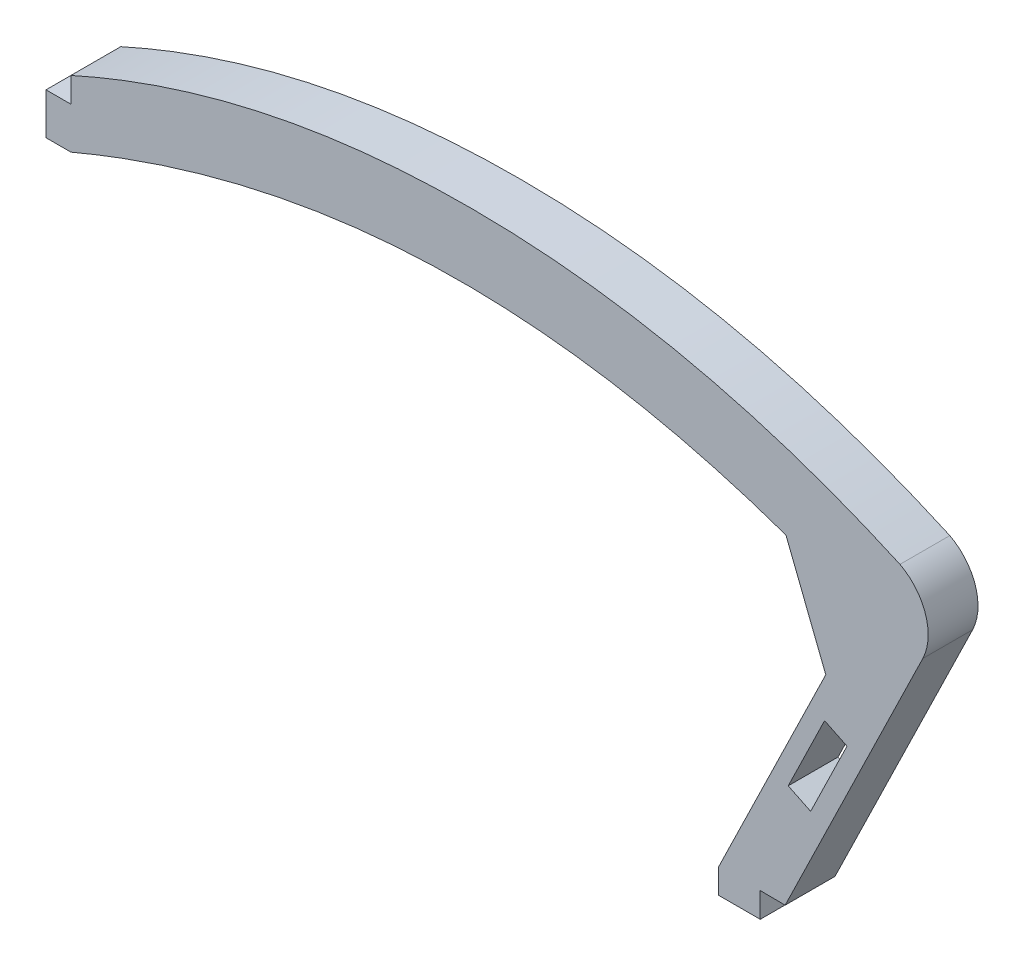
ISO-10303-21;
HEADER;
FILE_DESCRIPTION(('STEP AP214'),'2;1');
FILE_NAME('part.step','',(''),(''),'','','');
FILE_SCHEMA(('AUTOMOTIVE_DESIGN { 1 0 10303 214 1 1 1 1 }'));
ENDSEC;
DATA;
#1=APPLICATION_CONTEXT('core data for automotive mechanical design processes');
#2=APPLICATION_PROTOCOL_DEFINITION('international standard','automotive_design',2000,#1);
#3=PRODUCT_CONTEXT('',#1,'mechanical');
#4=PRODUCT('Part','Part','',(#3));
#5=PRODUCT_RELATED_PRODUCT_CATEGORY('part','',(#4));
#6=PRODUCT_DEFINITION_FORMATION('','',#4);
#7=PRODUCT_DEFINITION_CONTEXT('part definition',#1,'design');
#8=PRODUCT_DEFINITION('design','',#6,#7);
#9=PRODUCT_DEFINITION_SHAPE('','',#8);
#10=(LENGTH_UNIT() NAMED_UNIT(*) SI_UNIT(.MILLI.,.METRE.));
#11=(NAMED_UNIT(*) PLANE_ANGLE_UNIT() SI_UNIT($,.RADIAN.));
#12=(NAMED_UNIT(*) SI_UNIT($,.STERADIAN.) SOLID_ANGLE_UNIT());
#13=UNCERTAINTY_MEASURE_WITH_UNIT(LENGTH_MEASURE(1.E-05),#10,'distance_accuracy_value','');
#14=(GEOMETRIC_REPRESENTATION_CONTEXT(3) GLOBAL_UNCERTAINTY_ASSIGNED_CONTEXT((#13)) GLOBAL_UNIT_ASSIGNED_CONTEXT((#10,
#11,#12)) REPRESENTATION_CONTEXT('',''));
#15=CARTESIAN_POINT('',(0.,0.,0.));
#16=DIRECTION('',(0.,0.,1.));
#17=DIRECTION('',(1.,0.,0.));
#18=AXIS2_PLACEMENT_3D('',#15,#16,#17);
#19=CARTESIAN_POINT('',(18.8316095196413,36.7877841974259,6.));
#20=DIRECTION('',(0.,0.,-1.));
#21=DIRECTION('',(-1.,0.,0.));
#22=AXIS2_PLACEMENT_3D('',#19,#20,#21);
#23=CYLINDRICAL_SURFACE('',#22,6.38889912729138);
#24=CARTESIAN_POINT('',(18.8316095196413,36.7877841974259,0.));
#25=DIRECTION('',(0.,0.,1.));
#26=DIRECTION('',(1.,0.,0.));
#27=AXIS2_PLACEMENT_3D('',#24,#25,#26);
#28=CIRCLE('',#27,6.38889912729138);
#29=CARTESIAN_POINT('',(24.5748107662097,33.9889145148364,0.));
#30=VERTEX_POINT('',#29);
#31=CARTESIAN_POINT('',(21.8264630921922,42.4312657591645,0.));
#32=VERTEX_POINT('',#31);
#33=EDGE_CURVE('E211',#30,#32,#28,.T.);
#34=ORIENTED_EDGE('',*,*,#33,.T.);
#35=DIRECTION('',(0.,0.,-1.));
#36=VECTOR('',#35,1.);
#37=CARTESIAN_POINT('',(21.8264630921922,42.4312657591645,6.));
#38=LINE('',#37,#36);
#39=CARTESIAN_POINT('',(21.8264630921922,42.4312657591645,6.));
#40=VERTEX_POINT('',#39);
#41=EDGE_CURVE('E250',#40,#32,#38,.T.);
#42=ORIENTED_EDGE('',*,*,#41,.F.);
#43=CARTESIAN_POINT('',(18.8316095196413,36.7877841974259,6.));
#44=DIRECTION('',(0.,0.,1.));
#45=DIRECTION('',(1.,0.,0.));
#46=AXIS2_PLACEMENT_3D('',#43,#44,#45);
#47=CIRCLE('',#46,6.38889912729138);
#48=CARTESIAN_POINT('',(24.5748107662097,33.9889145148364,6.));
#49=VERTEX_POINT('',#48);
#50=EDGE_CURVE('E217',#49,#40,#47,.T.);
#51=ORIENTED_EDGE('',*,*,#50,.F.);
#52=DIRECTION('',(0.,0.,-1.));
#53=VECTOR('',#52,1.);
#54=CARTESIAN_POINT('',(24.5748107662097,33.9889145148364,6.));
#55=LINE('',#54,#53);
#56=EDGE_CURVE('E252',#49,#30,#55,.T.);
#57=ORIENTED_EDGE('',*,*,#56,.T.);
#58=EDGE_LOOP('',(#34,#42,#51,#57));
#59=FACE_BOUND('',#58,.T.);
#60=ADVANCED_FACE('F43',(#59),#23,.T.);
#61=CARTESIAN_POINT('',(21.8264630921922,42.4312657591645,6.));
#62=CARTESIAN_POINT('',(4.30347785726403,50.3433786545245,6.));
#63=CARTESIAN_POINT('',(-29.026405501552,57.0183047926159,6.));
#64=CARTESIAN_POINT('',(-62.2418203349168,50.6205074438955,6.));
#65=CARTESIAN_POINT('',(-77.9999999984884,43.5,6.));
#66=B_SPLINE_CURVE_WITH_KNOTS('',3,(#61,#62,#63,#64,#65),.UNSPECIFIED.,.F.,.F.,(4,1,4),
(0.0183848982386074,0.528855814446571,0.99108454483135),.UNSPECIFIED.);
#67=DIRECTION('',(0.,0.,-1.));
#68=VECTOR('',#67,1.);
#69=SURFACE_OF_LINEAR_EXTRUSION('',#66,#68);
#70=CARTESIAN_POINT('',(21.8264630921922,42.4312657591645,0.));
#71=CARTESIAN_POINT('',(4.30347785726403,50.3433786545245,0.));
#72=CARTESIAN_POINT('',(-29.026405501552,57.0183047926159,0.));
#73=CARTESIAN_POINT('',(-62.2418203349168,50.6205074438955,0.));
#74=CARTESIAN_POINT('',(-77.9999999984884,43.5,0.));
#75=B_SPLINE_CURVE_WITH_KNOTS('',3,(#70,#71,#72,#73,#74),.UNSPECIFIED.,.F.,.F.,(4,1,4),
(0.0183848982386074,0.528855814446571,0.99108454483135),.UNSPECIFIED.);
#76=CARTESIAN_POINT('',(-77.9999999984884,43.5,0.));
#77=VERTEX_POINT('',#76);
#78=EDGE_CURVE('E255',#32,#77,#75,.T.);
#79=ORIENTED_EDGE('',*,*,#78,.T.);
#80=DIRECTION('',(0.,0.,-1.));
#81=VECTOR('',#80,1.);
#82=CARTESIAN_POINT('',(-77.9999999984884,43.5,6.));
#83=LINE('',#82,#81);
#84=CARTESIAN_POINT('',(-77.9999999984884,43.5,6.));
#85=VERTEX_POINT('',#84);
#86=EDGE_CURVE('E345',#85,#77,#83,.T.);
#87=ORIENTED_EDGE('',*,*,#86,.F.);
#88=EDGE_CURVE('E221',#40,#85,#66,.T.);
#89=ORIENTED_EDGE('',*,*,#88,.F.);
#90=ORIENTED_EDGE('',*,*,#41,.T.);
#91=EDGE_LOOP('',(#79,#87,#89,#90));
#92=FACE_BOUND('',#91,.T.);
#93=ADVANCED_FACE('F234',(#92),#69,.F.);
#94=CARTESIAN_POINT('',(-77.9999999984884,0.,6.));
#95=DIRECTION('',(-1.,0.,0.));
#96=DIRECTION('',(0.,0.,1.));
#97=AXIS2_PLACEMENT_3D('',#94,#95,#96);
#98=PLANE('',#97);
#99=DIRECTION('',(0.,1.,0.));
#100=VECTOR('',#99,1.);
#101=CARTESIAN_POINT('',(-77.9999999984884,0.,0.));
#102=LINE('',#101,#100);
#103=CARTESIAN_POINT('',(-77.9999999984884,40.5,0.));
#104=VERTEX_POINT('',#103);
#105=EDGE_CURVE('E259',#104,#77,#102,.T.);
#106=ORIENTED_EDGE('',*,*,#105,.F.);
#107=DIRECTION('',(0.,0.,-1.));
#108=VECTOR('',#107,1.);
#109=CARTESIAN_POINT('',(-77.9999999984884,40.5,6.));
#110=LINE('',#109,#108);
#111=CARTESIAN_POINT('',(-77.9999999984884,40.5,6.));
#112=VERTEX_POINT('',#111);
#113=EDGE_CURVE('E342',#112,#104,#110,.T.);
#114=ORIENTED_EDGE('',*,*,#113,.F.);
#115=DIRECTION('',(0.,1.,0.));
#116=VECTOR('',#115,1.);
#117=CARTESIAN_POINT('',(-77.9999999984884,0.,6.));
#118=LINE('',#117,#116);
#119=EDGE_CURVE('E228',#112,#85,#118,.T.);
#120=ORIENTED_EDGE('',*,*,#119,.T.);
#121=ORIENTED_EDGE('',*,*,#86,.T.);
#122=EDGE_LOOP('',(#106,#114,#120,#121));
#123=FACE_BOUND('',#122,.T.);
#124=ADVANCED_FACE('F237',(#123),#98,.T.);
#125=CARTESIAN_POINT('',(0.,40.5,6.));
#126=DIRECTION('',(0.,1.,0.));
#127=DIRECTION('',(0.,0.,1.));
#128=AXIS2_PLACEMENT_3D('',#125,#126,#127);
#129=PLANE('',#128);
#130=DIRECTION('',(1.,0.,0.));
#131=VECTOR('',#130,1.);
#132=CARTESIAN_POINT('',(0.,40.5,0.));
#133=LINE('',#132,#131);
#134=CARTESIAN_POINT('',(-81.,40.5,0.));
#135=VERTEX_POINT('',#134);
#136=EDGE_CURVE('E273',#135,#104,#133,.T.);
#137=ORIENTED_EDGE('',*,*,#136,.F.);
#138=DIRECTION('',(0.,0.,-1.));
#139=VECTOR('',#138,1.);
#140=CARTESIAN_POINT('',(-81.,40.5,6.));
#141=LINE('',#140,#139);
#142=CARTESIAN_POINT('',(-81.,40.5,6.));
#143=VERTEX_POINT('',#142);
#144=EDGE_CURVE('E339',#143,#135,#141,.T.);
#145=ORIENTED_EDGE('',*,*,#144,.F.);
#146=DIRECTION('',(1.,0.,0.));
#147=VECTOR('',#146,1.);
#148=CARTESIAN_POINT('',(0.,40.5,6.));
#149=LINE('',#148,#147);
#150=EDGE_CURVE('E456',#143,#112,#149,.T.);
#151=ORIENTED_EDGE('',*,*,#150,.T.);
#152=ORIENTED_EDGE('',*,*,#113,.T.);
#153=EDGE_LOOP('',(#137,#145,#151,#152));
#154=FACE_BOUND('',#153,.T.);
#155=ADVANCED_FACE('F438',(#154),#129,.T.);
#156=CARTESIAN_POINT('',(-81.,0.,6.));
#157=DIRECTION('',(1.,0.,0.));
#158=DIRECTION('',(0.,0.,-1.));
#159=AXIS2_PLACEMENT_3D('',#156,#157,#158);
#160=PLANE('',#159);
#161=DIRECTION('',(0.,-1.,0.));
#162=VECTOR('',#161,1.);
#163=CARTESIAN_POINT('',(-81.,0.,0.));
#164=LINE('',#163,#162);
#165=CARTESIAN_POINT('',(-81.,35.5,0.));
#166=VERTEX_POINT('',#165);
#167=EDGE_CURVE('E277',#135,#166,#164,.T.);
#168=ORIENTED_EDGE('',*,*,#167,.T.);
#169=DIRECTION('',(0.,0.,-1.));
#170=VECTOR('',#169,1.);
#171=CARTESIAN_POINT('',(-81.,35.5,6.));
#172=LINE('',#171,#170);
#173=CARTESIAN_POINT('',(-81.,35.5,6.));
#174=VERTEX_POINT('',#173);
#175=EDGE_CURVE('E335',#174,#166,#172,.T.);
#176=ORIENTED_EDGE('',*,*,#175,.F.);
#177=DIRECTION('',(0.,-1.,0.));
#178=VECTOR('',#177,1.);
#179=CARTESIAN_POINT('',(-81.,0.,6.));
#180=LINE('',#179,#178);
#181=EDGE_CURVE('E454',#143,#174,#180,.T.);
#182=ORIENTED_EDGE('',*,*,#181,.F.);
#183=ORIENTED_EDGE('',*,*,#144,.T.);
#184=EDGE_LOOP('',(#168,#176,#182,#183));
#185=FACE_BOUND('',#184,.T.);
#186=ADVANCED_FACE('F435',(#185),#160,.F.);
#187=CARTESIAN_POINT('',(0.,35.5,6.));
#188=DIRECTION('',(0.,1.,0.));
#189=DIRECTION('',(0.,0.,1.));
#190=AXIS2_PLACEMENT_3D('',#187,#188,#189);
#191=PLANE('',#190);
#192=DIRECTION('',(1.,0.,0.));
#193=VECTOR('',#192,1.);
#194=CARTESIAN_POINT('',(0.,35.5,0.));
#195=LINE('',#194,#193);
#196=CARTESIAN_POINT('',(-78.,35.5,0.));
#197=VERTEX_POINT('',#196);
#198=EDGE_CURVE('E280',#166,#197,#195,.T.);
#199=ORIENTED_EDGE('',*,*,#198,.T.);
#200=DIRECTION('',(0.,0.,-1.));
#201=VECTOR('',#200,1.);
#202=CARTESIAN_POINT('',(-78.,35.5,6.));
#203=LINE('',#202,#201);
#204=CARTESIAN_POINT('',(-78.,35.5,6.));
#205=VERTEX_POINT('',#204);
#206=EDGE_CURVE('E331',#205,#197,#203,.T.);
#207=ORIENTED_EDGE('',*,*,#206,.F.);
#208=DIRECTION('',(1.,0.,0.));
#209=VECTOR('',#208,1.);
#210=CARTESIAN_POINT('',(0.,35.5,6.));
#211=LINE('',#210,#209);
#212=EDGE_CURVE('E386',#174,#205,#211,.T.);
#213=ORIENTED_EDGE('',*,*,#212,.F.);
#214=ORIENTED_EDGE('',*,*,#175,.T.);
#215=EDGE_LOOP('',(#199,#207,#213,#214));
#216=FACE_BOUND('',#215,.T.);
#217=ADVANCED_FACE('F432',(#216),#191,.F.);
#218=CARTESIAN_POINT('',(17.0926602157946,35.0736542216227,6.));
#219=CARTESIAN_POINT('',(-30.3832665780531,55.7115911074709,6.));
#220=CARTESIAN_POINT('',(-78.,35.5,6.));
#221=B_SPLINE_CURVE_WITH_KNOTS('',2,(#218,#219,#220),.UNSPECIFIED.,.F.,.F.,(3,3),(0.,1.),.UNSPECIFIED.);
#222=DIRECTION('',(0.,0.,-1.));
#223=VECTOR('',#222,1.);
#224=SURFACE_OF_LINEAR_EXTRUSION('',#221,#223);
#225=CARTESIAN_POINT('',(17.0926602157946,35.0736542216227,0.));
#226=CARTESIAN_POINT('',(-30.3832665780531,55.7115911074709,0.));
#227=CARTESIAN_POINT('',(-78.,35.5,0.));
#228=B_SPLINE_CURVE_WITH_KNOTS('',2,(#225,#226,#227),.UNSPECIFIED.,.F.,.F.,(3,3),(0.,1.),.UNSPECIFIED.);
#229=CARTESIAN_POINT('',(8.09625668724169,38.6172672474285,0.));
#230=VERTEX_POINT('',#229);
#231=EDGE_CURVE('E284',#230,#197,#228,.T.);
#232=ORIENTED_EDGE('',*,*,#231,.F.);
#233=DIRECTION('',(0.,0.,-1.));
#234=VECTOR('',#233,1.);
#235=CARTESIAN_POINT('',(8.09625668724169,38.6172672474285,0.));
#236=LINE('',#235,#234);
#237=CARTESIAN_POINT('',(8.09625668724169,38.6172672474285,6.));
#238=VERTEX_POINT('',#237);
#239=EDGE_CURVE('E354',#230,#238,#236,.F.);
#240=ORIENTED_EDGE('',*,*,#239,.T.);
#241=EDGE_CURVE('E375',#238,#205,#221,.T.);
#242=ORIENTED_EDGE('',*,*,#241,.T.);
#243=ORIENTED_EDGE('',*,*,#206,.T.);
#244=EDGE_LOOP('',(#232,#240,#242,#243));
#245=FACE_BOUND('',#244,.T.);
#246=ADVANCED_FACE('F365',(#245),#224,.T.);
#247=CARTESIAN_POINT('',(0.,0.,6.));
#248=DIRECTION('',(-0.898934406717328,0.438083248275673,0.));
#249=DIRECTION('',(-0.438083248275673,-0.898934406717329,0.));
#250=AXIS2_PLACEMENT_3D('',#247,#248,#249);
#251=PLANE('',#250);
#252=DIRECTION('',(0.438083248275673,0.898934406717329,0.));
#253=VECTOR('',#252,1.);
#254=CARTESIAN_POINT('',(0.,0.,6.));
#255=LINE('',#254,#253);
#256=CARTESIAN_POINT('',(0.,0.,6.));
#257=VERTEX_POINT('',#256);
#258=CARTESIAN_POINT('',(12.8902184456794,26.4503628397859,6.));
#259=VERTEX_POINT('',#258);
#260=EDGE_CURVE('E373',#257,#259,#255,.T.);
#261=ORIENTED_EDGE('',*,*,#260,.T.);
#262=DIRECTION('',(0.,0.,-1.));
#263=VECTOR('',#262,1.);
#264=CARTESIAN_POINT('',(12.8902184456794,26.4503628397859,0.));
#265=LINE('',#264,#263);
#266=CARTESIAN_POINT('',(12.8902184456794,26.4503628397859,0.));
#267=VERTEX_POINT('',#266);
#268=EDGE_CURVE('E350',#259,#267,#265,.T.);
#269=ORIENTED_EDGE('',*,*,#268,.T.);
#270=DIRECTION('',(0.438083248275673,0.898934406717329,0.));
#271=VECTOR('',#270,1.);
#272=CARTESIAN_POINT('',(0.,0.,0.));
#273=LINE('',#272,#271);
#274=CARTESIAN_POINT('',(0.,0.,0.));
#275=VERTEX_POINT('',#274);
#276=EDGE_CURVE('E289',#275,#267,#273,.T.);
#277=ORIENTED_EDGE('',*,*,#276,.F.);
#278=DIRECTION('',(0.,0.,-1.));
#279=VECTOR('',#278,1.);
#280=CARTESIAN_POINT('',(0.,0.,6.));
#281=LINE('',#280,#279);
#282=EDGE_CURVE('E328',#257,#275,#281,.T.);
#283=ORIENTED_EDGE('',*,*,#282,.F.);
#284=EDGE_LOOP('',(#261,#269,#277,#283));
#285=FACE_BOUND('',#284,.T.);
#286=ADVANCED_FACE('F377',(#285),#251,.T.);
#287=CARTESIAN_POINT('',(0.,0.,6.));
#288=DIRECTION('',(1.,0.,0.));
#289=DIRECTION('',(0.,1.,0.));
#290=AXIS2_PLACEMENT_3D('',#287,#288,#289);
#291=PLANE('',#290);
#292=DIRECTION('',(0.,-1.,0.));
#293=VECTOR('',#292,1.);
#294=CARTESIAN_POINT('',(0.,0.,0.));
#295=LINE('',#294,#293);
#296=CARTESIAN_POINT('',(0.,-3.,0.));
#297=VERTEX_POINT('',#296);
#298=EDGE_CURVE('E296',#275,#297,#295,.T.);
#299=ORIENTED_EDGE('',*,*,#298,.T.);
#300=DIRECTION('',(0.,0.,-1.));
#301=VECTOR('',#300,1.);
#302=CARTESIAN_POINT('',(0.,-3.,6.));
#303=LINE('',#302,#301);
#304=CARTESIAN_POINT('',(0.,-3.,6.));
#305=VERTEX_POINT('',#304);
#306=EDGE_CURVE('E324',#305,#297,#303,.T.);
#307=ORIENTED_EDGE('',*,*,#306,.F.);
#308=DIRECTION('',(0.,-1.,0.));
#309=VECTOR('',#308,1.);
#310=CARTESIAN_POINT('',(0.,0.,6.));
#311=LINE('',#310,#309);
#312=EDGE_CURVE('E380',#257,#305,#311,.T.);
#313=ORIENTED_EDGE('',*,*,#312,.F.);
#314=ORIENTED_EDGE('',*,*,#282,.T.);
#315=EDGE_LOOP('',(#299,#307,#313,#314));
#316=FACE_BOUND('',#315,.T.);
#317=ADVANCED_FACE('F419',(#316),#291,.F.);
#318=CARTESIAN_POINT('',(0.,-3.,6.));
#319=DIRECTION('',(0.,1.,0.));
#320=DIRECTION('',(0.,0.,1.));
#321=AXIS2_PLACEMENT_3D('',#318,#319,#320);
#322=PLANE('',#321);
#323=DIRECTION('',(1.,0.,0.));
#324=VECTOR('',#323,1.);
#325=CARTESIAN_POINT('',(0.,-3.,0.));
#326=LINE('',#325,#324);
#327=CARTESIAN_POINT('',(5.,-3.,0.));
#328=VERTEX_POINT('',#327);
#329=EDGE_CURVE('E299',#297,#328,#326,.T.);
#330=ORIENTED_EDGE('',*,*,#329,.T.);
#331=DIRECTION('',(0.,0.,-1.));
#332=VECTOR('',#331,1.);
#333=CARTESIAN_POINT('',(5.,-3.,6.));
#334=LINE('',#333,#332);
#335=CARTESIAN_POINT('',(5.,-3.,6.));
#336=VERTEX_POINT('',#335);
#337=EDGE_CURVE('E321',#336,#328,#334,.T.);
#338=ORIENTED_EDGE('',*,*,#337,.F.);
#339=DIRECTION('',(1.,0.,0.));
#340=VECTOR('',#339,1.);
#341=CARTESIAN_POINT('',(0.,-3.,6.));
#342=LINE('',#341,#340);
#343=EDGE_CURVE('E384',#305,#336,#342,.T.);
#344=ORIENTED_EDGE('',*,*,#343,.F.);
#345=ORIENTED_EDGE('',*,*,#306,.T.);
#346=EDGE_LOOP('',(#330,#338,#344,#345));
#347=FACE_BOUND('',#346,.T.);
#348=ADVANCED_FACE('F416',(#347),#322,.F.);
#349=CARTESIAN_POINT('',(5.,0.,6.));
#350=DIRECTION('',(1.,0.,0.));
#351=DIRECTION('',(0.,1.,0.));
#352=AXIS2_PLACEMENT_3D('',#349,#350,#351);
#353=PLANE('',#352);
#354=DIRECTION('',(0.,-1.,0.));
#355=VECTOR('',#354,1.);
#356=CARTESIAN_POINT('',(5.,0.,0.));
#357=LINE('',#356,#355);
#358=CARTESIAN_POINT('',(5.,0.,0.));
#359=VERTEX_POINT('',#358);
#360=EDGE_CURVE('E303',#359,#328,#357,.T.);
#361=ORIENTED_EDGE('',*,*,#360,.F.);
#362=DIRECTION('',(0.,0.,-1.));
#363=VECTOR('',#362,1.);
#364=CARTESIAN_POINT('',(5.,0.,6.));
#365=LINE('',#364,#363);
#366=CARTESIAN_POINT('',(5.,0.,6.));
#367=VERTEX_POINT('',#366);
#368=EDGE_CURVE('E318',#367,#359,#365,.T.);
#369=ORIENTED_EDGE('',*,*,#368,.F.);
#370=DIRECTION('',(0.,-1.,0.));
#371=VECTOR('',#370,1.);
#372=CARTESIAN_POINT('',(5.,0.,6.));
#373=LINE('',#372,#371);
#374=EDGE_CURVE('E395',#367,#336,#373,.T.);
#375=ORIENTED_EDGE('',*,*,#374,.T.);
#376=ORIENTED_EDGE('',*,*,#337,.T.);
#377=EDGE_LOOP('',(#361,#369,#375,#376));
#378=FACE_BOUND('',#377,.T.);
#379=ADVANCED_FACE('F412',(#378),#353,.T.);
#380=CARTESIAN_POINT('',(0.00027620653852076,0.0371612217580626,6.));
#381=DIRECTION('',(0.00743244964356645,0.999972378964687,0.));
#382=DIRECTION('',(-0.999972378964687,0.00743244964356645,0.));
#383=AXIS2_PLACEMENT_3D('',#380,#381,#382);
#384=PLANE('',#383);
#385=DIRECTION('',(0.999972378964687,-0.00743244964356645,0.));
#386=VECTOR('',#385,1.);
#387=CARTESIAN_POINT('',(0.00027620653852076,0.0371612217580626,0.));
#388=LINE('',#387,#386);
#389=CARTESIAN_POINT('',(7.99991713689406,-0.0222973489306987,0.));
#390=VERTEX_POINT('',#389);
#391=EDGE_CURVE('E307',#359,#390,#388,.T.);
#392=ORIENTED_EDGE('',*,*,#391,.T.);
#393=DIRECTION('',(0.,0.,-1.));
#394=VECTOR('',#393,1.);
#395=CARTESIAN_POINT('',(7.99991713689406,-0.0222973489306987,6.));
#396=LINE('',#395,#394);
#397=CARTESIAN_POINT('',(7.99991713689406,-0.0222973489306987,6.));
#398=VERTEX_POINT('',#397);
#399=EDGE_CURVE('E314',#398,#390,#396,.T.);
#400=ORIENTED_EDGE('',*,*,#399,.F.);
#401=DIRECTION('',(0.999972378964687,-0.00743244964356645,0.));
#402=VECTOR('',#401,1.);
#403=CARTESIAN_POINT('',(0.00027620653852076,0.0371612217580626,6.));
#404=LINE('',#403,#402);
#405=EDGE_CURVE('E398',#367,#398,#404,.T.);
#406=ORIENTED_EDGE('',*,*,#405,.F.);
#407=ORIENTED_EDGE('',*,*,#368,.T.);
#408=EDGE_LOOP('',(#392,#400,#406,#407));
#409=FACE_BOUND('',#408,.T.);
#410=ADVANCED_FACE('F521',(#409),#384,.F.);
#411=CARTESIAN_POINT('',(6.47337845709524,-3.15471144569716,6.));
#412=DIRECTION('',(-0.898934406717322,0.438083248275685,0.));
#413=DIRECTION('',(-0.438083248275686,-0.898934406717322,0.));
#414=AXIS2_PLACEMENT_3D('',#411,#412,#413);
#415=PLANE('',#414);
#416=DIRECTION('',(0.438083248275685,0.898934406717322,0.));
#417=VECTOR('',#416,1.);
#418=CARTESIAN_POINT('',(6.47337845709524,-3.15471144569716,0.));
#419=LINE('',#418,#417);
#420=EDGE_CURVE('E222',#390,#30,#419,.T.);
#421=ORIENTED_EDGE('',*,*,#420,.T.);
#422=ORIENTED_EDGE('',*,*,#56,.F.);
#423=DIRECTION('',(0.438083248275685,0.898934406717322,0.));
#424=VECTOR('',#423,1.);
#425=CARTESIAN_POINT('',(6.47337845709524,-3.15471144569716,6.));
#426=LINE('',#425,#424);
#427=EDGE_CURVE('E262',#398,#49,#426,.T.);
#428=ORIENTED_EDGE('',*,*,#427,.F.);
#429=ORIENTED_EDGE('',*,*,#399,.T.);
#430=EDGE_LOOP('',(#421,#422,#428,#429));
#431=FACE_BOUND('',#430,.T.);
#432=ADVANCED_FACE('F406',(#431),#415,.F.);
#433=CARTESIAN_POINT('',(0.,0.,6.));
#434=DIRECTION('',(0.,0.,1.));
#435=DIRECTION('',(1.,0.,0.));
#436=AXIS2_PLACEMENT_3D('',#433,#434,#435);
#437=PLANE('',#436);
#438=DIRECTION('',(0.898934406717328,-0.438083248275673,0.));
#439=VECTOR('',#438,1.);
#440=CARTESIAN_POINT('',(11.0659207577217,11.2935998593816,6.));
#441=LINE('',#440,#439);
#442=CARTESIAN_POINT('',(8.36911753756975,12.6078496042086,6.));
#443=VERTEX_POINT('',#442);
#444=CARTESIAN_POINT('',(11.0659207577217,11.2935998593816,6.));
#445=VERTEX_POINT('',#444);
#446=EDGE_CURVE('E59',#443,#445,#441,.T.);
#447=ORIENTED_EDGE('',*,*,#446,.F.);
#448=DIRECTION('',(-0.438083248275673,-0.898934406717328,0.));
#449=VECTOR('',#448,1.);
#450=CARTESIAN_POINT('',(8.36911753756975,12.6078496042086,6.));
#451=LINE('',#450,#449);
#452=CARTESIAN_POINT('',(12.7499500203265,21.5971936713819,6.));
#453=VERTEX_POINT('',#452);
#454=EDGE_CURVE('E189',#453,#443,#451,.T.);
#455=ORIENTED_EDGE('',*,*,#454,.F.);
#456=DIRECTION('',(-0.898934406717328,0.438083248275674,0.));
#457=VECTOR('',#456,1.);
#458=CARTESIAN_POINT('',(12.7499500203265,21.5971936713819,6.));
#459=LINE('',#458,#457);
#460=CARTESIAN_POINT('',(15.4467532404785,20.2829439265548,6.));
#461=VERTEX_POINT('',#460);
#462=EDGE_CURVE('E193',#461,#453,#459,.T.);
#463=ORIENTED_EDGE('',*,*,#462,.F.);
#464=DIRECTION('',(0.438083248275673,0.898934406717328,0.));
#465=VECTOR('',#464,1.);
#466=CARTESIAN_POINT('',(15.4467532404785,20.2829439265548,6.));
#467=LINE('',#466,#465);
#468=EDGE_CURVE('E202',#445,#461,#467,.T.);
#469=ORIENTED_EDGE('',*,*,#468,.F.);
#470=EDGE_LOOP('',(#447,#455,#463,#469));
#471=FACE_BOUND('',#470,.T.);
#472=ORIENTED_EDGE('',*,*,#50,.T.);
#473=ORIENTED_EDGE('',*,*,#88,.T.);
#474=ORIENTED_EDGE('',*,*,#119,.F.);
#475=ORIENTED_EDGE('',*,*,#150,.F.);
#476=ORIENTED_EDGE('',*,*,#181,.T.);
#477=ORIENTED_EDGE('',*,*,#212,.T.);
#478=ORIENTED_EDGE('',*,*,#241,.F.);
#479=DIRECTION('',(0.36658666268443,-0.930383909330924,0.));
#480=VECTOR('',#479,1.);
#481=CARTESIAN_POINT('',(12.8902184456794,26.4503628397859,6.));
#482=LINE('',#481,#480);
#483=EDGE_CURVE('E11',#238,#259,#482,.T.);
#484=ORIENTED_EDGE('',*,*,#483,.T.);
#485=ORIENTED_EDGE('',*,*,#260,.F.);
#486=ORIENTED_EDGE('',*,*,#312,.T.);
#487=ORIENTED_EDGE('',*,*,#343,.T.);
#488=ORIENTED_EDGE('',*,*,#374,.F.);
#489=ORIENTED_EDGE('',*,*,#405,.T.);
#490=ORIENTED_EDGE('',*,*,#427,.T.);
#491=EDGE_LOOP('',(#472,#473,#474,#475,#476,#477,#478,#484,#485,#486,#487,#488,#489,#490));
#492=FACE_BOUND('',#491,.T.);
#493=ADVANCED_FACE('F372',(#471,#492),#437,.T.);
#494=CARTESIAN_POINT('',(0.,0.,0.));
#495=DIRECTION('',(0.,0.,1.));
#496=DIRECTION('',(1.,0.,0.));
#497=AXIS2_PLACEMENT_3D('',#494,#495,#496);
#498=PLANE('',#497);
#499=DIRECTION('',(-0.438083248275673,-0.898934406717328,0.));
#500=VECTOR('',#499,1.);
#501=CARTESIAN_POINT('',(8.36911753756975,12.6078496042086,0.));
#502=LINE('',#501,#500);
#503=CARTESIAN_POINT('',(12.7499500203265,21.5971936713819,0.));
#504=VERTEX_POINT('',#503);
#505=CARTESIAN_POINT('',(8.36911753756975,12.6078496042086,0.));
#506=VERTEX_POINT('',#505);
#507=EDGE_CURVE('E177',#504,#506,#502,.T.);
#508=ORIENTED_EDGE('',*,*,#507,.T.);
#509=DIRECTION('',(0.898934406717328,-0.438083248275673,0.));
#510=VECTOR('',#509,1.);
#511=CARTESIAN_POINT('',(11.0659207577217,11.2935998593816,0.));
#512=LINE('',#511,#510);
#513=CARTESIAN_POINT('',(11.0659207577217,11.2935998593816,0.));
#514=VERTEX_POINT('',#513);
#515=EDGE_CURVE('E170',#506,#514,#512,.T.);
#516=ORIENTED_EDGE('',*,*,#515,.T.);
#517=DIRECTION('',(0.438083248275673,0.898934406717328,0.));
#518=VECTOR('',#517,1.);
#519=CARTESIAN_POINT('',(15.4467532404785,20.2829439265548,0.));
#520=LINE('',#519,#518);
#521=CARTESIAN_POINT('',(15.4467532404785,20.2829439265548,0.));
#522=VERTEX_POINT('',#521);
#523=EDGE_CURVE('E180',#514,#522,#520,.T.);
#524=ORIENTED_EDGE('',*,*,#523,.T.);
#525=DIRECTION('',(-0.898934406717328,0.438083248275674,0.));
#526=VECTOR('',#525,1.);
#527=CARTESIAN_POINT('',(12.7499500203265,21.5971936713819,0.));
#528=LINE('',#527,#526);
#529=EDGE_CURVE('E67',#522,#504,#528,.T.);
#530=ORIENTED_EDGE('',*,*,#529,.T.);
#531=EDGE_LOOP('',(#508,#516,#524,#530));
#532=FACE_BOUND('',#531,.T.);
#533=ORIENTED_EDGE('',*,*,#33,.F.);
#534=ORIENTED_EDGE('',*,*,#420,.F.);
#535=ORIENTED_EDGE('',*,*,#391,.F.);
#536=ORIENTED_EDGE('',*,*,#360,.T.);
#537=ORIENTED_EDGE('',*,*,#329,.F.);
#538=ORIENTED_EDGE('',*,*,#298,.F.);
#539=ORIENTED_EDGE('',*,*,#276,.T.);
#540=DIRECTION('',(-0.36658666268443,0.930383909330924,0.));
#541=VECTOR('',#540,1.);
#542=CARTESIAN_POINT('',(20.1792846120155,7.95097220307457,0.));
#543=LINE('',#542,#541);
#544=EDGE_CURVE('E52',#267,#230,#543,.T.);
#545=ORIENTED_EDGE('',*,*,#544,.T.);
#546=ORIENTED_EDGE('',*,*,#231,.T.);
#547=ORIENTED_EDGE('',*,*,#198,.F.);
#548=ORIENTED_EDGE('',*,*,#167,.F.);
#549=ORIENTED_EDGE('',*,*,#136,.T.);
#550=ORIENTED_EDGE('',*,*,#105,.T.);
#551=ORIENTED_EDGE('',*,*,#78,.F.);
#552=EDGE_LOOP('',(#533,#534,#535,#536,#537,#538,#539,#545,#546,#547,#548,#549,#550,#551));
#553=FACE_BOUND('',#552,.T.);
#554=ADVANCED_FACE('F185',(#532,#553),#498,.F.);
#555=CARTESIAN_POINT('',(12.8902184456794,26.4503628397859,3.));
#556=DIRECTION('',(0.930383909330924,0.36658666268443,0.));
#557=DIRECTION('',(0.,0.,-1.));
#558=AXIS2_PLACEMENT_3D('',#555,#556,#557);
#559=PLANE('',#558);
#560=ORIENTED_EDGE('',*,*,#483,.F.);
#561=ORIENTED_EDGE('',*,*,#239,.F.);
#562=ORIENTED_EDGE('',*,*,#544,.F.);
#563=ORIENTED_EDGE('',*,*,#268,.F.);
#564=EDGE_LOOP('',(#560,#561,#562,#563));
#565=FACE_BOUND('',#564,.T.);
#566=ADVANCED_FACE('F45',(#565),#559,.F.);
#567=CARTESIAN_POINT('',(11.0659207577217,11.2935998593816,0.));
#568=DIRECTION('',(-0.438083248275673,-0.898934406717328,0.));
#569=DIRECTION('',(0.898934406717329,-0.438083248275673,0.));
#570=AXIS2_PLACEMENT_3D('',#567,#568,#569);
#571=PLANE('',#570);
#572=ORIENTED_EDGE('',*,*,#446,.T.);
#573=DIRECTION('',(0.,0.,1.));
#574=VECTOR('',#573,1.);
#575=CARTESIAN_POINT('',(11.0659207577217,11.2935998593816,0.));
#576=LINE('',#575,#574);
#577=EDGE_CURVE('E166',#514,#445,#576,.T.);
#578=ORIENTED_EDGE('',*,*,#577,.F.);
#579=ORIENTED_EDGE('',*,*,#515,.F.);
#580=DIRECTION('',(0.,0.,1.));
#581=VECTOR('',#580,1.);
#582=CARTESIAN_POINT('',(8.36911753756975,12.6078496042086,0.));
#583=LINE('',#582,#581);
#584=EDGE_CURVE('E208',#506,#443,#583,.T.);
#585=ORIENTED_EDGE('',*,*,#584,.T.);
#586=EDGE_LOOP('',(#572,#578,#579,#585));
#587=FACE_BOUND('',#586,.T.);
#588=ADVANCED_FACE('F168',(#587),#571,.F.);
#589=CARTESIAN_POINT('',(8.36911753756975,12.6078496042086,0.));
#590=DIRECTION('',(-0.898934406717328,0.438083248275673,0.));
#591=DIRECTION('',(-0.438083248275673,-0.898934406717328,0.));
#592=AXIS2_PLACEMENT_3D('',#589,#590,#591);
#593=PLANE('',#592);
#594=ORIENTED_EDGE('',*,*,#454,.T.);
#595=ORIENTED_EDGE('',*,*,#584,.F.);
#596=ORIENTED_EDGE('',*,*,#507,.F.);
#597=DIRECTION('',(0.,0.,1.));
#598=VECTOR('',#597,1.);
#599=CARTESIAN_POINT('',(12.7499500203265,21.5971936713819,0.));
#600=LINE('',#599,#598);
#601=EDGE_CURVE('E212',#504,#453,#600,.T.);
#602=ORIENTED_EDGE('',*,*,#601,.T.);
#603=EDGE_LOOP('',(#594,#595,#596,#602));
#604=FACE_BOUND('',#603,.T.);
#605=ADVANCED_FACE('F561',(#604),#593,.F.);
#606=CARTESIAN_POINT('',(12.7499500203265,21.5971936713819,0.));
#607=DIRECTION('',(0.438083248275674,0.898934406717328,0.));
#608=DIRECTION('',(-0.898934406717328,0.438083248275674,0.));
#609=AXIS2_PLACEMENT_3D('',#606,#607,#608);
#610=PLANE('',#609);
#611=ORIENTED_EDGE('',*,*,#462,.T.);
#612=ORIENTED_EDGE('',*,*,#601,.F.);
#613=ORIENTED_EDGE('',*,*,#529,.F.);
#614=DIRECTION('',(0.,0.,1.));
#615=VECTOR('',#614,1.);
#616=CARTESIAN_POINT('',(15.4467532404785,20.2829439265548,0.));
#617=LINE('',#616,#615);
#618=EDGE_CURVE('E176',#522,#461,#617,.T.);
#619=ORIENTED_EDGE('',*,*,#618,.T.);
#620=EDGE_LOOP('',(#611,#612,#613,#619));
#621=FACE_BOUND('',#620,.T.);
#622=ADVANCED_FACE('F569',(#621),#610,.F.);
#623=CARTESIAN_POINT('',(15.4467532404785,20.2829439265548,0.));
#624=DIRECTION('',(0.898934406717328,-0.438083248275673,0.));
#625=DIRECTION('',(0.438083248275673,0.898934406717328,0.));
#626=AXIS2_PLACEMENT_3D('',#623,#624,#625);
#627=PLANE('',#626);
#628=ORIENTED_EDGE('',*,*,#468,.T.);
#629=ORIENTED_EDGE('',*,*,#618,.F.);
#630=ORIENTED_EDGE('',*,*,#523,.F.);
#631=ORIENTED_EDGE('',*,*,#577,.T.);
#632=EDGE_LOOP('',(#628,#629,#630,#631));
#633=FACE_BOUND('',#632,.T.);
#634=ADVANCED_FACE('F181',(#633),#627,.F.);
#635=CLOSED_SHELL('',(#60,#93,#124,#155,#186,#217,#246,#286,#317,#348,#379,#410,#432,#493,#554,
#566,#588,#605,#622,#634));
#636=MANIFOLD_SOLID_BREP('B2',#635);
#637=ADVANCED_BREP_SHAPE_REPRESENTATION('',(#18,#636),#14);
#638=SHAPE_DEFINITION_REPRESENTATION(#9,#637);
ENDSEC;
END-ISO-10303-21;
